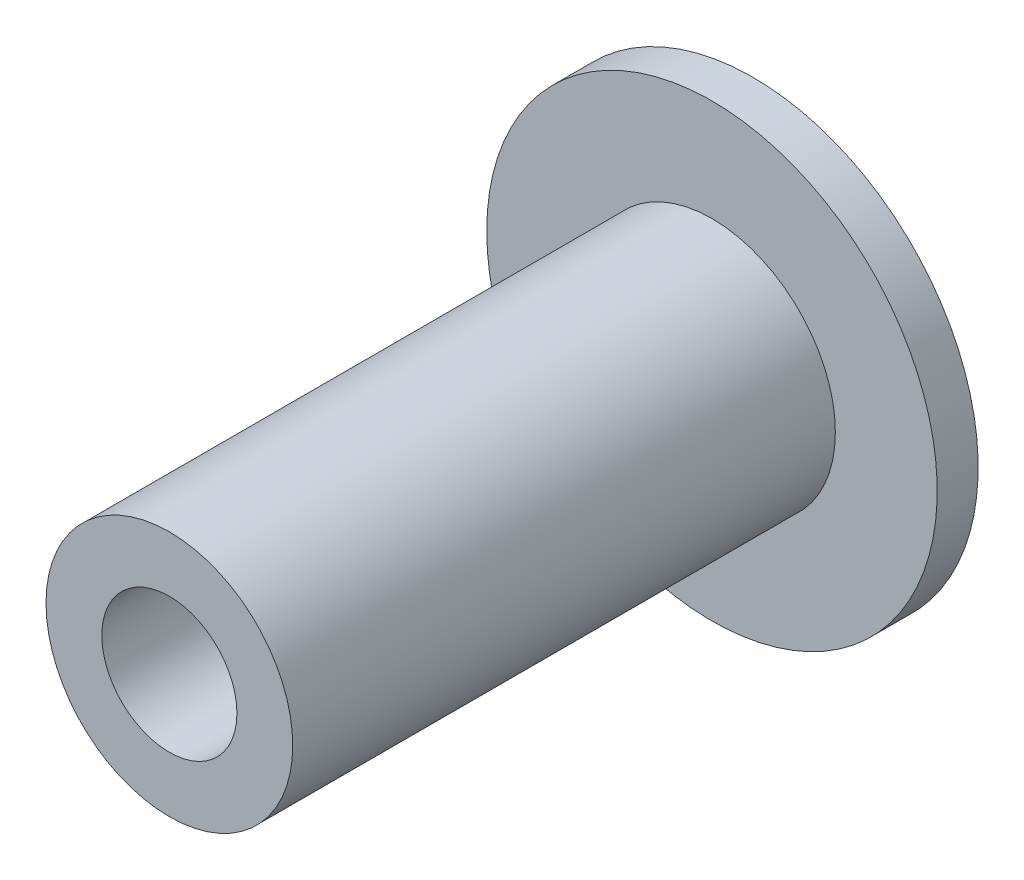
ISO-10303-21;
HEADER;
FILE_DESCRIPTION(('STEP AP214'),'2;1');
FILE_NAME('part.step','',(''),(''),'','','');
FILE_SCHEMA(('AUTOMOTIVE_DESIGN { 1 0 10303 214 1 1 1 1 }'));
ENDSEC;
DATA;
#1=APPLICATION_CONTEXT('core data for automotive mechanical design processes');
#2=APPLICATION_PROTOCOL_DEFINITION('international standard','automotive_design',2000,#1);
#3=PRODUCT_CONTEXT('',#1,'mechanical');
#4=PRODUCT('Part','Part','',(#3));
#5=PRODUCT_RELATED_PRODUCT_CATEGORY('part','',(#4));
#6=PRODUCT_DEFINITION_FORMATION('','',#4);
#7=PRODUCT_DEFINITION_CONTEXT('part definition',#1,'design');
#8=PRODUCT_DEFINITION('design','',#6,#7);
#9=PRODUCT_DEFINITION_SHAPE('','',#8);
#10=(LENGTH_UNIT() NAMED_UNIT(*) SI_UNIT(.MILLI.,.METRE.));
#11=(NAMED_UNIT(*) PLANE_ANGLE_UNIT() SI_UNIT($,.RADIAN.));
#12=(NAMED_UNIT(*) SI_UNIT($,.STERADIAN.) SOLID_ANGLE_UNIT());
#13=UNCERTAINTY_MEASURE_WITH_UNIT(LENGTH_MEASURE(1.E-05),#10,'distance_accuracy_value','');
#14=(GEOMETRIC_REPRESENTATION_CONTEXT(3) GLOBAL_UNCERTAINTY_ASSIGNED_CONTEXT((#13)) GLOBAL_UNIT_ASSIGNED_CONTEXT((#10,
#11,#12)) REPRESENTATION_CONTEXT('',''));
#15=CARTESIAN_POINT('',(0.,0.,0.));
#16=DIRECTION('',(0.,0.,1.));
#17=DIRECTION('',(1.,0.,0.));
#18=AXIS2_PLACEMENT_3D('',#15,#16,#17);
#19=CARTESIAN_POINT('',(0.,0.,10.));
#20=DIRECTION('',(0.,0.,-1.));
#21=DIRECTION('',(-1.,0.,0.));
#22=AXIS2_PLACEMENT_3D('',#19,#20,#21);
#23=CYLINDRICAL_SURFACE('',#22,6.025);
#24=CARTESIAN_POINT('',(0.,0.,0.));
#25=DIRECTION('',(0.,0.,1.));
#26=DIRECTION('',(1.,0.,0.));
#27=AXIS2_PLACEMENT_3D('',#24,#25,#26);
#28=CIRCLE('',#27,6.025);
#29=CARTESIAN_POINT('',(6.025,0.,0.));
#30=VERTEX_POINT('',#29);
#31=EDGE_CURVE('E35',#30,#30,#28,.T.);
#32=ORIENTED_EDGE('',*,*,#31,.T.);
#33=EDGE_LOOP('',(#32));
#34=FACE_BOUND('',#33,.T.);
#35=CARTESIAN_POINT('',(0.,0.,26.5));
#36=DIRECTION('',(0.,0.,1.));
#37=DIRECTION('',(1.,0.,0.));
#38=AXIS2_PLACEMENT_3D('',#35,#36,#37);
#39=CIRCLE('',#38,6.025);
#40=CARTESIAN_POINT('',(6.025,0.,26.5));
#41=VERTEX_POINT('',#40);
#42=EDGE_CURVE('E10',#41,#41,#39,.T.);
#43=ORIENTED_EDGE('',*,*,#42,.F.);
#44=EDGE_LOOP('',(#43));
#45=FACE_BOUND('',#44,.T.);
#46=ADVANCED_FACE('F32',(#34,#45),#23,.T.);
#47=CARTESIAN_POINT('',(0.,0.,26.5));
#48=DIRECTION('',(0.,0.,1.));
#49=DIRECTION('',(1.,0.,0.));
#50=AXIS2_PLACEMENT_3D('',#47,#48,#49);
#51=PLANE('',#50);
#52=CARTESIAN_POINT('',(0.,0.,26.5));
#53=DIRECTION('',(0.,0.,1.));
#54=DIRECTION('',(1.,0.,0.));
#55=AXIS2_PLACEMENT_3D('',#52,#53,#54);
#56=CIRCLE('',#55,3.3);
#57=CARTESIAN_POINT('',(3.3,0.,26.5));
#58=VERTEX_POINT('',#57);
#59=EDGE_CURVE('E50',#58,#58,#56,.T.);
#60=ORIENTED_EDGE('',*,*,#59,.F.);
#61=EDGE_LOOP('',(#60));
#62=FACE_BOUND('',#61,.T.);
#63=ORIENTED_EDGE('',*,*,#42,.T.);
#64=EDGE_LOOP('',(#63));
#65=FACE_BOUND('',#64,.T.);
#66=ADVANCED_FACE('F66',(#62,#65),#51,.T.);
#67=CARTESIAN_POINT('',(0.,0.,-2.));
#68=DIRECTION('',(0.,0.,1.));
#69=DIRECTION('',(1.,0.,0.));
#70=AXIS2_PLACEMENT_3D('',#67,#68,#69);
#71=CYLINDRICAL_SURFACE('',#70,11.);
#72=CARTESIAN_POINT('',(0.,0.,-2.));
#73=DIRECTION('',(0.,0.,-1.));
#74=DIRECTION('',(-1.,0.,0.));
#75=AXIS2_PLACEMENT_3D('',#72,#73,#74);
#76=CIRCLE('',#75,11.);
#77=CARTESIAN_POINT('',(-11.,0.,-2.));
#78=VERTEX_POINT('',#77);
#79=EDGE_CURVE('E42',#78,#78,#76,.T.);
#80=ORIENTED_EDGE('',*,*,#79,.F.);
#81=EDGE_LOOP('',(#80));
#82=FACE_BOUND('',#81,.T.);
#83=CARTESIAN_POINT('',(0.,0.,0.));
#84=DIRECTION('',(0.,0.,-1.));
#85=DIRECTION('',(-1.,0.,0.));
#86=AXIS2_PLACEMENT_3D('',#83,#84,#85);
#87=CIRCLE('',#86,11.);
#88=CARTESIAN_POINT('',(-11.,0.,0.));
#89=VERTEX_POINT('',#88);
#90=EDGE_CURVE('E44',#89,#89,#87,.T.);
#91=ORIENTED_EDGE('',*,*,#90,.T.);
#92=EDGE_LOOP('',(#91));
#93=FACE_BOUND('',#92,.T.);
#94=ADVANCED_FACE('F68',(#82,#93),#71,.T.);
#95=CARTESIAN_POINT('',(0.,0.,-2.));
#96=DIRECTION('',(0.,0.,-1.));
#97=DIRECTION('',(-1.,0.,0.));
#98=AXIS2_PLACEMENT_3D('',#95,#96,#97);
#99=PLANE('',#98);
#100=CARTESIAN_POINT('',(0.,0.,-2.));
#101=DIRECTION('',(0.,0.,1.));
#102=DIRECTION('',(1.,0.,0.));
#103=AXIS2_PLACEMENT_3D('',#100,#101,#102);
#104=CIRCLE('',#103,3.3);
#105=CARTESIAN_POINT('',(3.3,0.,-2.));
#106=VERTEX_POINT('',#105);
#107=EDGE_CURVE('E47',#106,#106,#104,.T.);
#108=ORIENTED_EDGE('',*,*,#107,.T.);
#109=EDGE_LOOP('',(#108));
#110=FACE_BOUND('',#109,.T.);
#111=ORIENTED_EDGE('',*,*,#79,.T.);
#112=EDGE_LOOP('',(#111));
#113=FACE_BOUND('',#112,.T.);
#114=ADVANCED_FACE('F56',(#110,#113),#99,.T.);
#115=CARTESIAN_POINT('',(0.,0.,0.));
#116=DIRECTION('',(0.,0.,-1.));
#117=DIRECTION('',(-1.,0.,0.));
#118=AXIS2_PLACEMENT_3D('',#115,#116,#117);
#119=PLANE('',#118);
#120=ORIENTED_EDGE('',*,*,#31,.F.);
#121=EDGE_LOOP('',(#120));
#122=FACE_BOUND('',#121,.T.);
#123=ORIENTED_EDGE('',*,*,#90,.F.);
#124=EDGE_LOOP('',(#123));
#125=FACE_BOUND('',#124,.T.);
#126=ADVANCED_FACE('F62',(#122,#125),#119,.F.);
#127=CARTESIAN_POINT('',(0.,0.,-2.));
#128=DIRECTION('',(0.,0.,1.));
#129=DIRECTION('',(1.,0.,0.));
#130=AXIS2_PLACEMENT_3D('',#127,#128,#129);
#131=CYLINDRICAL_SURFACE('',#130,3.3);
#132=ORIENTED_EDGE('',*,*,#107,.F.);
#133=EDGE_LOOP('',(#132));
#134=FACE_BOUND('',#133,.T.);
#135=ORIENTED_EDGE('',*,*,#59,.T.);
#136=EDGE_LOOP('',(#135));
#137=FACE_BOUND('',#136,.T.);
#138=ADVANCED_FACE('F59',(#134,#137),#131,.F.);
#139=CLOSED_SHELL('',(#46,#66,#94,#114,#126,#138));
#140=MANIFOLD_SOLID_BREP('B2',#139);
#141=ADVANCED_BREP_SHAPE_REPRESENTATION('',(#18,#140),#14);
#142=SHAPE_DEFINITION_REPRESENTATION(#9,#141);
ENDSEC;
END-ISO-10303-21;
